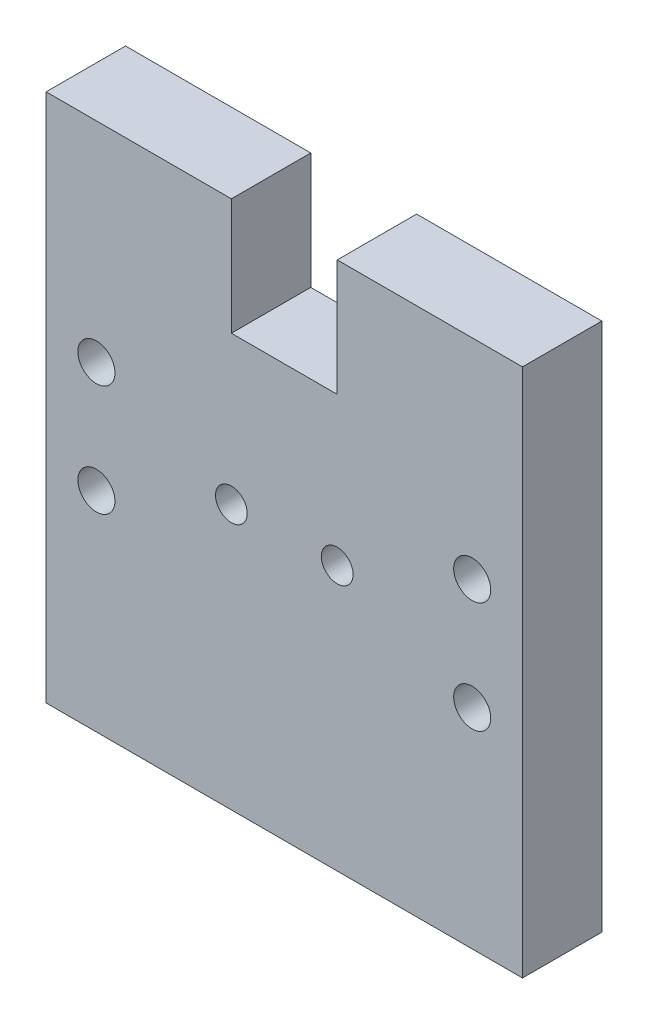
ISO-10303-21;
HEADER;
FILE_DESCRIPTION(('STEP AP214'),'2;1');
FILE_NAME('part.step','',(''),(''),'','','');
FILE_SCHEMA(('AUTOMOTIVE_DESIGN { 1 0 10303 214 1 1 1 1 }'));
ENDSEC;
DATA;
#1=APPLICATION_CONTEXT('core data for automotive mechanical design processes');
#2=APPLICATION_PROTOCOL_DEFINITION('international standard','automotive_design',2000,#1);
#3=PRODUCT_CONTEXT('',#1,'mechanical');
#4=PRODUCT('Part','Part','',(#3));
#5=PRODUCT_RELATED_PRODUCT_CATEGORY('part','',(#4));
#6=PRODUCT_DEFINITION_FORMATION('','',#4);
#7=PRODUCT_DEFINITION_CONTEXT('part definition',#1,'design');
#8=PRODUCT_DEFINITION('design','',#6,#7);
#9=PRODUCT_DEFINITION_SHAPE('','',#8);
#10=(LENGTH_UNIT() NAMED_UNIT(*) SI_UNIT(.MILLI.,.METRE.));
#11=(NAMED_UNIT(*) PLANE_ANGLE_UNIT() SI_UNIT($,.RADIAN.));
#12=(NAMED_UNIT(*) SI_UNIT($,.STERADIAN.) SOLID_ANGLE_UNIT());
#13=UNCERTAINTY_MEASURE_WITH_UNIT(LENGTH_MEASURE(1.E-05),#10,'distance_accuracy_value','');
#14=(GEOMETRIC_REPRESENTATION_CONTEXT(3) GLOBAL_UNCERTAINTY_ASSIGNED_CONTEXT((#13)) GLOBAL_UNIT_ASSIGNED_CONTEXT((#10,
#11,#12)) REPRESENTATION_CONTEXT('',''));
#15=CARTESIAN_POINT('',(0.,0.,0.));
#16=DIRECTION('',(0.,0.,1.));
#17=DIRECTION('',(1.,0.,0.));
#18=AXIS2_PLACEMENT_3D('',#15,#16,#17);
#19=CARTESIAN_POINT('',(205.418436725941,126.33354891424,15.));
#20=DIRECTION('',(0.,-1.,0.));
#21=DIRECTION('',(1.,0.,0.));
#22=AXIS2_PLACEMENT_3D('',#19,#20,#21);
#23=PLANE('',#22);
#24=DIRECTION('',(-1.,0.,0.));
#25=VECTOR('',#24,1.);
#26=CARTESIAN_POINT('',(205.418436725941,126.33354891424,15.));
#27=LINE('',#26,#25);
#28=CARTESIAN_POINT('',(240.41843672594,126.33354891424,15.));
#29=VERTEX_POINT('',#28);
#30=CARTESIAN_POINT('',(205.418436725941,126.33354891424,15.));
#31=VERTEX_POINT('',#30);
#32=EDGE_CURVE('E56',#29,#31,#27,.T.);
#33=ORIENTED_EDGE('',*,*,#32,.F.);
#34=DIRECTION('',(0.,0.,1.));
#35=VECTOR('',#34,1.);
#36=CARTESIAN_POINT('',(240.41843672594,126.33354891424,0.));
#37=LINE('',#36,#35);
#38=CARTESIAN_POINT('',(240.41843672594,126.33354891424,0.));
#39=VERTEX_POINT('',#38);
#40=EDGE_CURVE('E135',#39,#29,#37,.T.);
#41=ORIENTED_EDGE('',*,*,#40,.F.);
#42=DIRECTION('',(-1.,0.,0.));
#43=VECTOR('',#42,1.);
#44=CARTESIAN_POINT('',(205.418436725941,126.33354891424,0.));
#45=LINE('',#44,#43);
#46=CARTESIAN_POINT('',(205.418436725941,126.33354891424,0.));
#47=VERTEX_POINT('',#46);
#48=EDGE_CURVE('E78',#39,#47,#45,.T.);
#49=ORIENTED_EDGE('',*,*,#48,.T.);
#50=DIRECTION('',(0.,0.,-1.));
#51=VECTOR('',#50,1.);
#52=CARTESIAN_POINT('',(205.418436725941,126.33354891424,15.));
#53=LINE('',#52,#51);
#54=EDGE_CURVE('E186',#31,#47,#53,.T.);
#55=ORIENTED_EDGE('',*,*,#54,.F.);
#56=EDGE_LOOP('',(#33,#41,#49,#55));
#57=FACE_BOUND('',#56,.T.);
#58=ADVANCED_FACE('F32',(#57),#23,.F.);
#59=CARTESIAN_POINT('',(0.,0.,15.));
#60=DIRECTION('',(0.,0.,1.));
#61=DIRECTION('',(1.,0.,0.));
#62=AXIS2_PLACEMENT_3D('',#59,#60,#61);
#63=PLANE('',#62);
#64=DIRECTION('',(0.,-1.,0.));
#65=VECTOR('',#64,1.);
#66=CARTESIAN_POINT('',(240.41843672594,126.33354891424,15.));
#67=LINE('',#66,#65);
#68=CARTESIAN_POINT('',(240.41843672594,104.33354891424,15.));
#69=VERTEX_POINT('',#68);
#70=EDGE_CURVE('E111',#29,#69,#67,.T.);
#71=ORIENTED_EDGE('',*,*,#70,.F.);
#72=ORIENTED_EDGE('',*,*,#32,.T.);
#73=DIRECTION('',(0.,-1.,0.));
#74=VECTOR('',#73,1.);
#75=CARTESIAN_POINT('',(205.418436725941,126.33354891424,15.));
#76=LINE('',#75,#74);
#77=CARTESIAN_POINT('',(205.41843672594,26.3335489142399,15.));
#78=VERTEX_POINT('',#77);
#79=EDGE_CURVE('E177',#31,#78,#76,.T.);
#80=ORIENTED_EDGE('',*,*,#79,.T.);
#81=DIRECTION('',(1.,0.,0.));
#82=VECTOR('',#81,1.);
#83=CARTESIAN_POINT('',(205.41843672594,26.3335489142399,15.));
#84=LINE('',#83,#82);
#85=CARTESIAN_POINT('',(295.418436725941,26.3335489142399,15.));
#86=VERTEX_POINT('',#85);
#87=EDGE_CURVE('E85',#78,#86,#84,.T.);
#88=ORIENTED_EDGE('',*,*,#87,.T.);
#89=DIRECTION('',(0.,1.,0.));
#90=VECTOR('',#89,1.);
#91=CARTESIAN_POINT('',(295.41843672594,126.33354891424,15.));
#92=LINE('',#91,#90);
#93=CARTESIAN_POINT('',(295.41843672594,126.33354891424,15.));
#94=VERTEX_POINT('',#93);
#95=EDGE_CURVE('E181',#86,#94,#92,.T.);
#96=ORIENTED_EDGE('',*,*,#95,.T.);
#97=CARTESIAN_POINT('',(260.41843672594,126.33354891424,15.));
#98=VERTEX_POINT('',#97);
#99=EDGE_CURVE('E183',#94,#98,#27,.T.);
#100=ORIENTED_EDGE('',*,*,#99,.T.);
#101=DIRECTION('',(0.,1.,0.));
#102=VECTOR('',#101,1.);
#103=CARTESIAN_POINT('',(260.418436725941,126.33354891424,15.));
#104=LINE('',#103,#102);
#105=CARTESIAN_POINT('',(260.418436725941,104.33354891424,15.));
#106=VERTEX_POINT('',#105);
#107=EDGE_CURVE('E47',#106,#98,#104,.T.);
#108=ORIENTED_EDGE('',*,*,#107,.F.);
#109=DIRECTION('',(1.,0.,0.));
#110=VECTOR('',#109,1.);
#111=CARTESIAN_POINT('',(240.41843672594,104.33354891424,15.));
#112=LINE('',#111,#110);
#113=EDGE_CURVE('E129',#69,#106,#112,.T.);
#114=ORIENTED_EDGE('',*,*,#113,.F.);
#115=EDGE_LOOP('',(#71,#72,#80,#88,#96,#100,#108,#114));
#116=FACE_BOUND('',#115,.T.);
#117=CARTESIAN_POINT('',(285.918436725941,86.8335489142399,15.));
#118=DIRECTION('',(0.,0.,1.));
#119=DIRECTION('',(1.,0.,0.));
#120=AXIS2_PLACEMENT_3D('',#117,#118,#119);
#121=CIRCLE('',#120,3.50000000000002);
#122=CARTESIAN_POINT('',(289.418436725941,86.8335489142399,15.));
#123=VERTEX_POINT('',#122);
#124=EDGE_CURVE('E147',#123,#123,#121,.T.);
#125=ORIENTED_EDGE('',*,*,#124,.F.);
#126=EDGE_LOOP('',(#125));
#127=FACE_BOUND('',#126,.T.);
#128=CARTESIAN_POINT('',(214.918436725941,86.8335489142398,15.));
#129=DIRECTION('',(0.,0.,1.));
#130=DIRECTION('',(1.,0.,0.));
#131=AXIS2_PLACEMENT_3D('',#128,#129,#130);
#132=CIRCLE('',#131,3.49999999999999);
#133=CARTESIAN_POINT('',(218.418436725941,86.8335489142398,15.));
#134=VERTEX_POINT('',#133);
#135=EDGE_CURVE('E159',#134,#134,#132,.T.);
#136=ORIENTED_EDGE('',*,*,#135,.F.);
#137=EDGE_LOOP('',(#136));
#138=FACE_BOUND('',#137,.T.);
#139=CARTESIAN_POINT('',(260.418436725941,76.3335489142399,15.));
#140=DIRECTION('',(0.,0.,1.));
#141=DIRECTION('',(1.,0.,0.));
#142=AXIS2_PLACEMENT_3D('',#139,#140,#141);
#143=CIRCLE('',#142,2.99999999999999);
#144=CARTESIAN_POINT('',(263.418436725941,76.3335489142399,15.));
#145=VERTEX_POINT('',#144);
#146=EDGE_CURVE('E171',#145,#145,#143,.T.);
#147=ORIENTED_EDGE('',*,*,#146,.F.);
#148=EDGE_LOOP('',(#147));
#149=FACE_BOUND('',#148,.T.);
#150=CARTESIAN_POINT('',(240.418436725941,76.3335489142399,15.));
#151=DIRECTION('',(0.,0.,1.));
#152=DIRECTION('',(-1.,0.,0.));
#153=AXIS2_PLACEMENT_3D('',#150,#151,#152);
#154=CIRCLE('',#153,2.99999999999999);
#155=CARTESIAN_POINT('',(237.418436725941,76.3335489142399,15.));
#156=VERTEX_POINT('',#155);
#157=EDGE_CURVE('E165',#156,#156,#154,.T.);
#158=ORIENTED_EDGE('',*,*,#157,.F.);
#159=EDGE_LOOP('',(#158));
#160=FACE_BOUND('',#159,.T.);
#161=CARTESIAN_POINT('',(214.918436725941,65.8335489142399,15.));
#162=DIRECTION('',(0.,0.,1.));
#163=DIRECTION('',(1.,0.,0.));
#164=AXIS2_PLACEMENT_3D('',#161,#162,#163);
#165=CIRCLE('',#164,3.50000000000002);
#166=CARTESIAN_POINT('',(218.418436725941,65.8335489142399,15.));
#167=VERTEX_POINT('',#166);
#168=EDGE_CURVE('E153',#167,#167,#165,.T.);
#169=ORIENTED_EDGE('',*,*,#168,.F.);
#170=EDGE_LOOP('',(#169));
#171=FACE_BOUND('',#170,.T.);
#172=CARTESIAN_POINT('',(285.918436725941,65.83354891424,15.));
#173=DIRECTION('',(0.,0.,1.));
#174=DIRECTION('',(1.,0.,0.));
#175=AXIS2_PLACEMENT_3D('',#172,#173,#174);
#176=CIRCLE('',#175,3.50000000000002);
#177=CARTESIAN_POINT('',(289.418436725941,65.83354891424,15.));
#178=VERTEX_POINT('',#177);
#179=EDGE_CURVE('E141',#178,#178,#176,.T.);
#180=ORIENTED_EDGE('',*,*,#179,.F.);
#181=EDGE_LOOP('',(#180));
#182=FACE_BOUND('',#181,.T.);
#183=ADVANCED_FACE('F208',(#116,#127,#138,#149,#160,#171,#182),#63,.T.);
#184=CARTESIAN_POINT('',(0.,0.,0.));
#185=DIRECTION('',(0.,0.,1.));
#186=DIRECTION('',(1.,0.,0.));
#187=AXIS2_PLACEMENT_3D('',#184,#185,#186);
#188=PLANE('',#187);
#189=ORIENTED_EDGE('',*,*,#48,.F.);
#190=DIRECTION('',(0.,-1.,0.));
#191=VECTOR('',#190,1.);
#192=CARTESIAN_POINT('',(240.41843672594,126.33354891424,0.));
#193=LINE('',#192,#191);
#194=CARTESIAN_POINT('',(240.41843672594,104.33354891424,0.));
#195=VERTEX_POINT('',#194);
#196=EDGE_CURVE('E110',#39,#195,#193,.T.);
#197=ORIENTED_EDGE('',*,*,#196,.T.);
#198=DIRECTION('',(1.,0.,0.));
#199=VECTOR('',#198,1.);
#200=CARTESIAN_POINT('',(240.41843672594,104.33354891424,0.));
#201=LINE('',#200,#199);
#202=CARTESIAN_POINT('',(260.418436725941,104.33354891424,0.));
#203=VERTEX_POINT('',#202);
#204=EDGE_CURVE('E119',#195,#203,#201,.T.);
#205=ORIENTED_EDGE('',*,*,#204,.T.);
#206=DIRECTION('',(0.,1.,0.));
#207=VECTOR('',#206,1.);
#208=CARTESIAN_POINT('',(260.418436725941,126.33354891424,0.));
#209=LINE('',#208,#207);
#210=CARTESIAN_POINT('',(260.418436725941,126.33354891424,0.));
#211=VERTEX_POINT('',#210);
#212=EDGE_CURVE('E116',#203,#211,#209,.T.);
#213=ORIENTED_EDGE('',*,*,#212,.T.);
#214=CARTESIAN_POINT('',(295.41843672594,126.33354891424,0.));
#215=VERTEX_POINT('',#214);
#216=EDGE_CURVE('E179',#215,#211,#45,.T.);
#217=ORIENTED_EDGE('',*,*,#216,.F.);
#218=DIRECTION('',(0.,1.,0.));
#219=VECTOR('',#218,1.);
#220=CARTESIAN_POINT('',(295.41843672594,126.33354891424,0.));
#221=LINE('',#220,#219);
#222=CARTESIAN_POINT('',(295.418436725941,26.3335489142399,0.));
#223=VERTEX_POINT('',#222);
#224=EDGE_CURVE('E191',#223,#215,#221,.T.);
#225=ORIENTED_EDGE('',*,*,#224,.F.);
#226=DIRECTION('',(1.,0.,0.));
#227=VECTOR('',#226,1.);
#228=CARTESIAN_POINT('',(205.41843672594,26.3335489142399,0.));
#229=LINE('',#228,#227);
#230=CARTESIAN_POINT('',(205.41843672594,26.3335489142399,0.));
#231=VERTEX_POINT('',#230);
#232=EDGE_CURVE('E189',#231,#223,#229,.T.);
#233=ORIENTED_EDGE('',*,*,#232,.F.);
#234=DIRECTION('',(0.,-1.,0.));
#235=VECTOR('',#234,1.);
#236=CARTESIAN_POINT('',(205.418436725941,126.33354891424,0.));
#237=LINE('',#236,#235);
#238=EDGE_CURVE('E174',#47,#231,#237,.T.);
#239=ORIENTED_EDGE('',*,*,#238,.F.);
#240=EDGE_LOOP('',(#189,#197,#205,#213,#217,#225,#233,#239));
#241=FACE_BOUND('',#240,.T.);
#242=CARTESIAN_POINT('',(260.418436725941,76.3335489142399,0.));
#243=DIRECTION('',(0.,0.,1.));
#244=DIRECTION('',(1.,0.,0.));
#245=AXIS2_PLACEMENT_3D('',#242,#243,#244);
#246=CIRCLE('',#245,2.99999999999999);
#247=CARTESIAN_POINT('',(263.418436725941,76.3335489142399,0.));
#248=VERTEX_POINT('',#247);
#249=EDGE_CURVE('E168',#248,#248,#246,.T.);
#250=ORIENTED_EDGE('',*,*,#249,.T.);
#251=EDGE_LOOP('',(#250));
#252=FACE_BOUND('',#251,.T.);
#253=CARTESIAN_POINT('',(240.418436725941,76.3335489142399,0.));
#254=DIRECTION('',(0.,0.,1.));
#255=DIRECTION('',(-1.,0.,0.));
#256=AXIS2_PLACEMENT_3D('',#253,#254,#255);
#257=CIRCLE('',#256,2.99999999999999);
#258=CARTESIAN_POINT('',(237.418436725941,76.3335489142399,0.));
#259=VERTEX_POINT('',#258);
#260=EDGE_CURVE('E162',#259,#259,#257,.T.);
#261=ORIENTED_EDGE('',*,*,#260,.T.);
#262=EDGE_LOOP('',(#261));
#263=FACE_BOUND('',#262,.T.);
#264=CARTESIAN_POINT('',(214.918436725941,86.8335489142398,0.));
#265=DIRECTION('',(0.,0.,1.));
#266=DIRECTION('',(1.,0.,0.));
#267=AXIS2_PLACEMENT_3D('',#264,#265,#266);
#268=CIRCLE('',#267,3.49999999999999);
#269=CARTESIAN_POINT('',(218.418436725941,86.8335489142398,0.));
#270=VERTEX_POINT('',#269);
#271=EDGE_CURVE('E156',#270,#270,#268,.T.);
#272=ORIENTED_EDGE('',*,*,#271,.T.);
#273=EDGE_LOOP('',(#272));
#274=FACE_BOUND('',#273,.T.);
#275=CARTESIAN_POINT('',(214.918436725941,65.8335489142399,0.));
#276=DIRECTION('',(0.,0.,1.));
#277=DIRECTION('',(1.,0.,0.));
#278=AXIS2_PLACEMENT_3D('',#275,#276,#277);
#279=CIRCLE('',#278,3.50000000000002);
#280=CARTESIAN_POINT('',(218.418436725941,65.8335489142399,0.));
#281=VERTEX_POINT('',#280);
#282=EDGE_CURVE('E150',#281,#281,#279,.T.);
#283=ORIENTED_EDGE('',*,*,#282,.T.);
#284=EDGE_LOOP('',(#283));
#285=FACE_BOUND('',#284,.T.);
#286=CARTESIAN_POINT('',(285.918436725941,86.8335489142399,0.));
#287=DIRECTION('',(0.,0.,1.));
#288=DIRECTION('',(1.,0.,0.));
#289=AXIS2_PLACEMENT_3D('',#286,#287,#288);
#290=CIRCLE('',#289,3.50000000000002);
#291=CARTESIAN_POINT('',(289.418436725941,86.8335489142399,0.));
#292=VERTEX_POINT('',#291);
#293=EDGE_CURVE('E144',#292,#292,#290,.T.);
#294=ORIENTED_EDGE('',*,*,#293,.T.);
#295=EDGE_LOOP('',(#294));
#296=FACE_BOUND('',#295,.T.);
#297=CARTESIAN_POINT('',(285.918436725941,65.83354891424,0.));
#298=DIRECTION('',(0.,0.,1.));
#299=DIRECTION('',(1.,0.,0.));
#300=AXIS2_PLACEMENT_3D('',#297,#298,#299);
#301=CIRCLE('',#300,3.50000000000002);
#302=CARTESIAN_POINT('',(289.418436725941,65.83354891424,0.));
#303=VERTEX_POINT('',#302);
#304=EDGE_CURVE('E137',#303,#303,#301,.T.);
#305=ORIENTED_EDGE('',*,*,#304,.T.);
#306=EDGE_LOOP('',(#305));
#307=FACE_BOUND('',#306,.T.);
#308=ADVANCED_FACE('F125',(#241,#252,#263,#274,#285,#296,#307),#188,.F.);
#309=CARTESIAN_POINT('',(205.418436725941,126.33354891424,15.));
#310=DIRECTION('',(1.,0.,0.));
#311=DIRECTION('',(0.,1.,0.));
#312=AXIS2_PLACEMENT_3D('',#309,#310,#311);
#313=PLANE('',#312);
#314=ORIENTED_EDGE('',*,*,#238,.T.);
#315=DIRECTION('',(0.,0.,-1.));
#316=VECTOR('',#315,1.);
#317=CARTESIAN_POINT('',(205.41843672594,26.3335489142399,15.));
#318=LINE('',#317,#316);
#319=EDGE_CURVE('E11',#78,#231,#318,.T.);
#320=ORIENTED_EDGE('',*,*,#319,.F.);
#321=ORIENTED_EDGE('',*,*,#79,.F.);
#322=ORIENTED_EDGE('',*,*,#54,.T.);
#323=EDGE_LOOP('',(#314,#320,#321,#322));
#324=FACE_BOUND('',#323,.T.);
#325=ADVANCED_FACE('F34',(#324),#313,.F.);
#326=CARTESIAN_POINT('',(205.41843672594,26.3335489142399,15.));
#327=DIRECTION('',(0.,1.,0.));
#328=DIRECTION('',(-1.,0.,0.));
#329=AXIS2_PLACEMENT_3D('',#326,#327,#328);
#330=PLANE('',#329);
#331=ORIENTED_EDGE('',*,*,#232,.T.);
#332=DIRECTION('',(0.,0.,-1.));
#333=VECTOR('',#332,1.);
#334=CARTESIAN_POINT('',(295.418436725941,26.3335489142399,15.));
#335=LINE('',#334,#333);
#336=EDGE_CURVE('E40',#86,#223,#335,.T.);
#337=ORIENTED_EDGE('',*,*,#336,.F.);
#338=ORIENTED_EDGE('',*,*,#87,.F.);
#339=ORIENTED_EDGE('',*,*,#319,.T.);
#340=EDGE_LOOP('',(#331,#337,#338,#339));
#341=FACE_BOUND('',#340,.T.);
#342=ADVANCED_FACE('F213',(#341),#330,.F.);
#343=CARTESIAN_POINT('',(295.41843672594,126.33354891424,15.));
#344=DIRECTION('',(-1.,0.,0.));
#345=DIRECTION('',(0.,-1.,0.));
#346=AXIS2_PLACEMENT_3D('',#343,#344,#345);
#347=PLANE('',#346);
#348=ORIENTED_EDGE('',*,*,#224,.T.);
#349=DIRECTION('',(0.,0.,-1.));
#350=VECTOR('',#349,1.);
#351=CARTESIAN_POINT('',(295.41843672594,126.33354891424,15.));
#352=LINE('',#351,#350);
#353=EDGE_CURVE('E196',#94,#215,#352,.T.);
#354=ORIENTED_EDGE('',*,*,#353,.F.);
#355=ORIENTED_EDGE('',*,*,#95,.F.);
#356=ORIENTED_EDGE('',*,*,#336,.T.);
#357=EDGE_LOOP('',(#348,#354,#355,#356));
#358=FACE_BOUND('',#357,.T.);
#359=ADVANCED_FACE('F202',(#358),#347,.F.);
#360=ORIENTED_EDGE('',*,*,#216,.T.);
#361=DIRECTION('',(0.,0.,1.));
#362=VECTOR('',#361,1.);
#363=CARTESIAN_POINT('',(260.418436725941,126.33354891424,0.));
#364=LINE('',#363,#362);
#365=EDGE_CURVE('E138',#211,#98,#364,.T.);
#366=ORIENTED_EDGE('',*,*,#365,.T.);
#367=ORIENTED_EDGE('',*,*,#99,.F.);
#368=ORIENTED_EDGE('',*,*,#353,.T.);
#369=EDGE_LOOP('',(#360,#366,#367,#368));
#370=FACE_BOUND('',#369,.T.);
#371=ADVANCED_FACE('F206',(#370),#23,.F.);
#372=CARTESIAN_POINT('',(260.418436725941,76.3335489142399,15.));
#373=DIRECTION('',(0.,0.,-1.));
#374=DIRECTION('',(-1.,0.,0.));
#375=AXIS2_PLACEMENT_3D('',#372,#373,#374);
#376=CYLINDRICAL_SURFACE('',#375,2.99999999999999);
#377=ORIENTED_EDGE('',*,*,#146,.T.);
#378=EDGE_LOOP('',(#377));
#379=FACE_BOUND('',#378,.T.);
#380=ORIENTED_EDGE('',*,*,#249,.F.);
#381=EDGE_LOOP('',(#380));
#382=FACE_BOUND('',#381,.T.);
#383=ADVANCED_FACE('F228',(#379,#382),#376,.F.);
#384=CARTESIAN_POINT('',(240.418436725941,76.3335489142399,15.));
#385=DIRECTION('',(0.,0.,-1.));
#386=DIRECTION('',(-1.,0.,0.));
#387=AXIS2_PLACEMENT_3D('',#384,#385,#386);
#388=CYLINDRICAL_SURFACE('',#387,2.99999999999999);
#389=ORIENTED_EDGE('',*,*,#157,.T.);
#390=EDGE_LOOP('',(#389));
#391=FACE_BOUND('',#390,.T.);
#392=ORIENTED_EDGE('',*,*,#260,.F.);
#393=EDGE_LOOP('',(#392));
#394=FACE_BOUND('',#393,.T.);
#395=ADVANCED_FACE('F232',(#391,#394),#388,.F.);
#396=CARTESIAN_POINT('',(214.918436725941,86.8335489142398,15.));
#397=DIRECTION('',(0.,0.,-1.));
#398=DIRECTION('',(-1.,0.,0.));
#399=AXIS2_PLACEMENT_3D('',#396,#397,#398);
#400=CYLINDRICAL_SURFACE('',#399,3.49999999999999);
#401=ORIENTED_EDGE('',*,*,#135,.T.);
#402=EDGE_LOOP('',(#401));
#403=FACE_BOUND('',#402,.T.);
#404=ORIENTED_EDGE('',*,*,#271,.F.);
#405=EDGE_LOOP('',(#404));
#406=FACE_BOUND('',#405,.T.);
#407=ADVANCED_FACE('F238',(#403,#406),#400,.F.);
#408=CARTESIAN_POINT('',(214.918436725941,65.8335489142399,15.));
#409=DIRECTION('',(0.,0.,-1.));
#410=DIRECTION('',(-1.,0.,0.));
#411=AXIS2_PLACEMENT_3D('',#408,#409,#410);
#412=CYLINDRICAL_SURFACE('',#411,3.50000000000002);
#413=ORIENTED_EDGE('',*,*,#168,.T.);
#414=EDGE_LOOP('',(#413));
#415=FACE_BOUND('',#414,.T.);
#416=ORIENTED_EDGE('',*,*,#282,.F.);
#417=EDGE_LOOP('',(#416));
#418=FACE_BOUND('',#417,.T.);
#419=ADVANCED_FACE('F282',(#415,#418),#412,.F.);
#420=CARTESIAN_POINT('',(285.918436725941,86.8335489142399,15.));
#421=DIRECTION('',(0.,0.,-1.));
#422=DIRECTION('',(-1.,0.,0.));
#423=AXIS2_PLACEMENT_3D('',#420,#421,#422);
#424=CYLINDRICAL_SURFACE('',#423,3.50000000000002);
#425=ORIENTED_EDGE('',*,*,#124,.T.);
#426=EDGE_LOOP('',(#425));
#427=FACE_BOUND('',#426,.T.);
#428=ORIENTED_EDGE('',*,*,#293,.F.);
#429=EDGE_LOOP('',(#428));
#430=FACE_BOUND('',#429,.T.);
#431=ADVANCED_FACE('F291',(#427,#430),#424,.F.);
#432=CARTESIAN_POINT('',(285.918436725941,65.83354891424,15.));
#433=DIRECTION('',(0.,0.,-1.));
#434=DIRECTION('',(-1.,0.,0.));
#435=AXIS2_PLACEMENT_3D('',#432,#433,#434);
#436=CYLINDRICAL_SURFACE('',#435,3.50000000000002);
#437=ORIENTED_EDGE('',*,*,#179,.T.);
#438=EDGE_LOOP('',(#437));
#439=FACE_BOUND('',#438,.T.);
#440=ORIENTED_EDGE('',*,*,#304,.F.);
#441=EDGE_LOOP('',(#440));
#442=FACE_BOUND('',#441,.T.);
#443=ADVANCED_FACE('F301',(#439,#442),#436,.F.);
#444=CARTESIAN_POINT('',(240.41843672594,126.33354891424,0.));
#445=DIRECTION('',(-1.,0.,0.));
#446=DIRECTION('',(0.,0.,1.));
#447=AXIS2_PLACEMENT_3D('',#444,#445,#446);
#448=PLANE('',#447);
#449=ORIENTED_EDGE('',*,*,#70,.T.);
#450=DIRECTION('',(0.,0.,1.));
#451=VECTOR('',#450,1.);
#452=CARTESIAN_POINT('',(240.41843672594,104.33354891424,0.));
#453=LINE('',#452,#451);
#454=EDGE_CURVE('E106',#195,#69,#453,.T.);
#455=ORIENTED_EDGE('',*,*,#454,.F.);
#456=ORIENTED_EDGE('',*,*,#196,.F.);
#457=ORIENTED_EDGE('',*,*,#40,.T.);
#458=EDGE_LOOP('',(#449,#455,#456,#457));
#459=FACE_BOUND('',#458,.T.);
#460=ADVANCED_FACE('F108',(#459),#448,.F.);
#461=CARTESIAN_POINT('',(260.418436725941,126.33354891424,0.));
#462=DIRECTION('',(1.,0.,0.));
#463=DIRECTION('',(0.,0.,-1.));
#464=AXIS2_PLACEMENT_3D('',#461,#462,#463);
#465=PLANE('',#464);
#466=ORIENTED_EDGE('',*,*,#107,.T.);
#467=ORIENTED_EDGE('',*,*,#365,.F.);
#468=ORIENTED_EDGE('',*,*,#212,.F.);
#469=DIRECTION('',(0.,0.,1.));
#470=VECTOR('',#469,1.);
#471=CARTESIAN_POINT('',(260.418436725941,104.33354891424,0.));
#472=LINE('',#471,#470);
#473=EDGE_CURVE('E115',#203,#106,#472,.T.);
#474=ORIENTED_EDGE('',*,*,#473,.T.);
#475=EDGE_LOOP('',(#466,#467,#468,#474));
#476=FACE_BOUND('',#475,.T.);
#477=ADVANCED_FACE('F331',(#476),#465,.F.);
#478=CARTESIAN_POINT('',(240.41843672594,104.33354891424,0.));
#479=DIRECTION('',(0.,-1.,0.));
#480=DIRECTION('',(0.,0.,-1.));
#481=AXIS2_PLACEMENT_3D('',#478,#479,#480);
#482=PLANE('',#481);
#483=ORIENTED_EDGE('',*,*,#113,.T.);
#484=ORIENTED_EDGE('',*,*,#473,.F.);
#485=ORIENTED_EDGE('',*,*,#204,.F.);
#486=ORIENTED_EDGE('',*,*,#454,.T.);
#487=EDGE_LOOP('',(#483,#484,#485,#486));
#488=FACE_BOUND('',#487,.T.);
#489=ADVANCED_FACE('F120',(#488),#482,.F.);
#490=CLOSED_SHELL('',(#58,#183,#308,#325,#342,#359,#371,#383,#395,#407,#419,#431,#443,#460,#477,#489));
#491=MANIFOLD_SOLID_BREP('B2',#490);
#492=ADVANCED_BREP_SHAPE_REPRESENTATION('',(#18,#491),#14);
#493=SHAPE_DEFINITION_REPRESENTATION(#9,#492);
ENDSEC;
END-ISO-10303-21;
